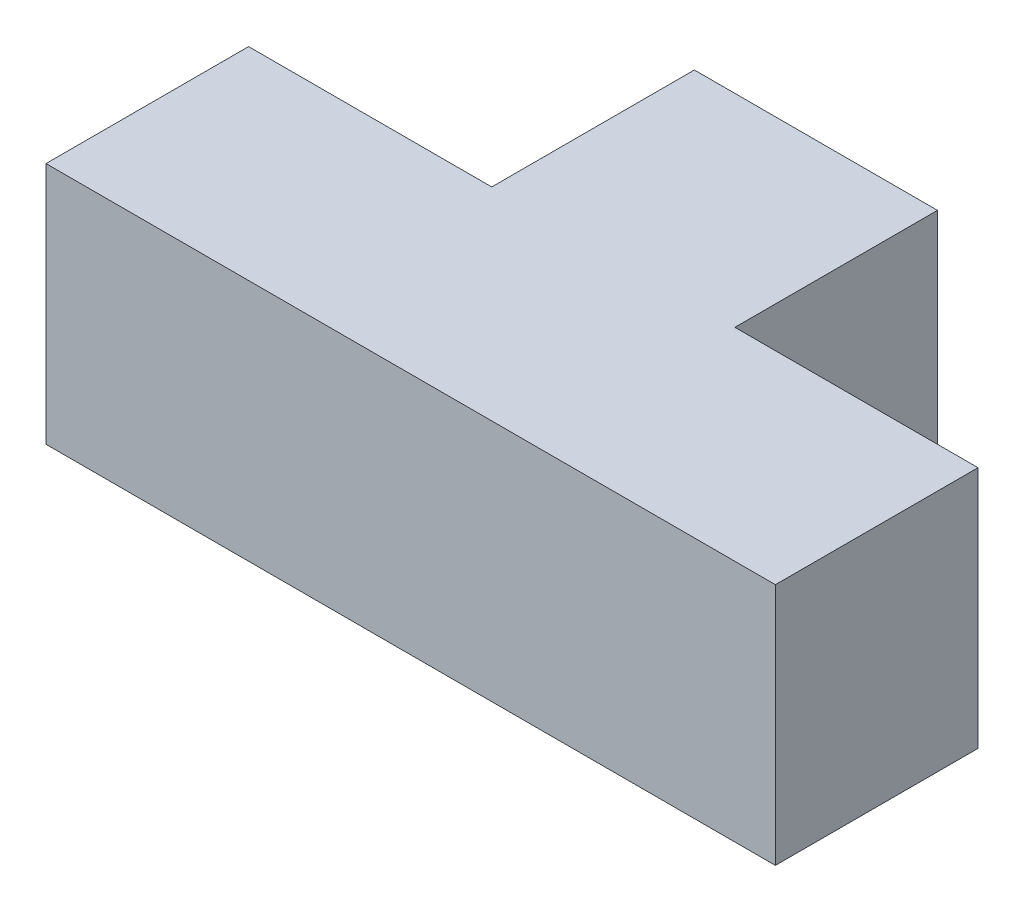
ISO-10303-21;
HEADER;
FILE_DESCRIPTION(('STEP AP214'),'2;1');
FILE_NAME('part.step','',(''),(''),'','','');
FILE_SCHEMA(('AUTOMOTIVE_DESIGN { 1 0 10303 214 1 1 1 1 }'));
ENDSEC;
DATA;
#1=APPLICATION_CONTEXT('core data for automotive mechanical design processes');
#2=APPLICATION_PROTOCOL_DEFINITION('international standard','automotive_design',2000,#1);
#3=PRODUCT_CONTEXT('',#1,'mechanical');
#4=PRODUCT('Part','Part','',(#3));
#5=PRODUCT_RELATED_PRODUCT_CATEGORY('part','',(#4));
#6=PRODUCT_DEFINITION_FORMATION('','',#4);
#7=PRODUCT_DEFINITION_CONTEXT('part definition',#1,'design');
#8=PRODUCT_DEFINITION('design','',#6,#7);
#9=PRODUCT_DEFINITION_SHAPE('','',#8);
#10=(LENGTH_UNIT() NAMED_UNIT(*) SI_UNIT(.MILLI.,.METRE.));
#11=(NAMED_UNIT(*) PLANE_ANGLE_UNIT() SI_UNIT($,.RADIAN.));
#12=(NAMED_UNIT(*) SI_UNIT($,.STERADIAN.) SOLID_ANGLE_UNIT());
#13=UNCERTAINTY_MEASURE_WITH_UNIT(LENGTH_MEASURE(1.E-05),#10,'distance_accuracy_value','');
#14=(GEOMETRIC_REPRESENTATION_CONTEXT(3) GLOBAL_UNCERTAINTY_ASSIGNED_CONTEXT((#13)) GLOBAL_UNIT_ASSIGNED_CONTEXT((#10,
#11,#12)) REPRESENTATION_CONTEXT('',''));
#15=CARTESIAN_POINT('',(0.,0.,0.));
#16=DIRECTION('',(0.,0.,1.));
#17=DIRECTION('',(1.,0.,0.));
#18=AXIS2_PLACEMENT_3D('',#15,#16,#17);
#19=CARTESIAN_POINT('',(0.,30.,-25.));
#20=DIRECTION('',(1.,0.,0.));
#21=DIRECTION('',(0.,0.,-1.));
#22=AXIS2_PLACEMENT_3D('',#19,#20,#21);
#23=PLANE('',#22);
#24=DIRECTION('',(0.,0.,1.));
#25=VECTOR('',#24,1.);
#26=CARTESIAN_POINT('',(0.,0.,-25.));
#27=LINE('',#26,#25);
#28=CARTESIAN_POINT('',(0.,0.,-25.));
#29=VERTEX_POINT('',#28);
#30=CARTESIAN_POINT('',(0.,0.,0.));
#31=VERTEX_POINT('',#30);
#32=EDGE_CURVE('E129',#29,#31,#27,.T.);
#33=ORIENTED_EDGE('',*,*,#32,.T.);
#34=DIRECTION('',(0.,-1.,0.));
#35=VECTOR('',#34,1.);
#36=CARTESIAN_POINT('',(0.,30.,0.));
#37=LINE('',#36,#35);
#38=CARTESIAN_POINT('',(0.,30.,0.));
#39=VERTEX_POINT('',#38);
#40=EDGE_CURVE('E11',#39,#31,#37,.T.);
#41=ORIENTED_EDGE('',*,*,#40,.F.);
#42=DIRECTION('',(0.,0.,1.));
#43=VECTOR('',#42,1.);
#44=CARTESIAN_POINT('',(0.,30.,-25.));
#45=LINE('',#44,#43);
#46=CARTESIAN_POINT('',(0.,30.,-25.));
#47=VERTEX_POINT('',#46);
#48=EDGE_CURVE('E143',#47,#39,#45,.T.);
#49=ORIENTED_EDGE('',*,*,#48,.F.);
#50=DIRECTION('',(0.,-1.,0.));
#51=VECTOR('',#50,1.);
#52=CARTESIAN_POINT('',(0.,30.,-25.));
#53=LINE('',#52,#51);
#54=EDGE_CURVE('E125',#47,#29,#53,.T.);
#55=ORIENTED_EDGE('',*,*,#54,.T.);
#56=EDGE_LOOP('',(#33,#41,#49,#55));
#57=FACE_BOUND('',#56,.T.);
#58=ADVANCED_FACE('F33',(#57),#23,.F.);
#59=CARTESIAN_POINT('',(0.,30.,0.));
#60=DIRECTION('',(0.,0.,-1.));
#61=DIRECTION('',(-1.,0.,0.));
#62=AXIS2_PLACEMENT_3D('',#59,#60,#61);
#63=PLANE('',#62);
#64=DIRECTION('',(1.,0.,0.));
#65=VECTOR('',#64,1.);
#66=CARTESIAN_POINT('',(0.,0.,0.));
#67=LINE('',#66,#65);
#68=CARTESIAN_POINT('',(90.,0.,0.));
#69=VERTEX_POINT('',#68);
#70=EDGE_CURVE('E132',#31,#69,#67,.T.);
#71=ORIENTED_EDGE('',*,*,#70,.T.);
#72=DIRECTION('',(0.,-1.,0.));
#73=VECTOR('',#72,1.);
#74=CARTESIAN_POINT('',(90.,30.,0.));
#75=LINE('',#74,#73);
#76=CARTESIAN_POINT('',(90.,30.,0.));
#77=VERTEX_POINT('',#76);
#78=EDGE_CURVE('E41',#77,#69,#75,.T.);
#79=ORIENTED_EDGE('',*,*,#78,.F.);
#80=DIRECTION('',(1.,0.,0.));
#81=VECTOR('',#80,1.);
#82=CARTESIAN_POINT('',(0.,30.,0.));
#83=LINE('',#82,#81);
#84=EDGE_CURVE('E92',#39,#77,#83,.T.);
#85=ORIENTED_EDGE('',*,*,#84,.F.);
#86=ORIENTED_EDGE('',*,*,#40,.T.);
#87=EDGE_LOOP('',(#71,#79,#85,#86));
#88=FACE_BOUND('',#87,.T.);
#89=ADVANCED_FACE('F178',(#88),#63,.F.);
#90=CARTESIAN_POINT('',(90.,30.,0.));
#91=DIRECTION('',(-1.,0.,0.));
#92=DIRECTION('',(0.,0.,1.));
#93=AXIS2_PLACEMENT_3D('',#90,#91,#92);
#94=PLANE('',#93);
#95=DIRECTION('',(0.,0.,-1.));
#96=VECTOR('',#95,1.);
#97=CARTESIAN_POINT('',(90.,0.,0.));
#98=LINE('',#97,#96);
#99=CARTESIAN_POINT('',(90.,0.,-25.));
#100=VERTEX_POINT('',#99);
#101=EDGE_CURVE('E134',#69,#100,#98,.T.);
#102=ORIENTED_EDGE('',*,*,#101,.T.);
#103=DIRECTION('',(0.,-1.,0.));
#104=VECTOR('',#103,1.);
#105=CARTESIAN_POINT('',(90.,30.,-25.));
#106=LINE('',#105,#104);
#107=CARTESIAN_POINT('',(90.,30.,-25.));
#108=VERTEX_POINT('',#107);
#109=EDGE_CURVE('E150',#108,#100,#106,.T.);
#110=ORIENTED_EDGE('',*,*,#109,.F.);
#111=DIRECTION('',(0.,0.,-1.));
#112=VECTOR('',#111,1.);
#113=CARTESIAN_POINT('',(90.,30.,0.));
#114=LINE('',#113,#112);
#115=EDGE_CURVE('E158',#77,#108,#114,.T.);
#116=ORIENTED_EDGE('',*,*,#115,.F.);
#117=ORIENTED_EDGE('',*,*,#78,.T.);
#118=EDGE_LOOP('',(#102,#110,#116,#117));
#119=FACE_BOUND('',#118,.T.);
#120=ADVANCED_FACE('F156',(#119),#94,.F.);
#121=CARTESIAN_POINT('',(90.,30.,-25.));
#122=DIRECTION('',(0.,0.,1.));
#123=DIRECTION('',(1.,0.,0.));
#124=AXIS2_PLACEMENT_3D('',#121,#122,#123);
#125=PLANE('',#124);
#126=DIRECTION('',(-1.,0.,0.));
#127=VECTOR('',#126,1.);
#128=CARTESIAN_POINT('',(90.,0.,-25.));
#129=LINE('',#128,#127);
#130=CARTESIAN_POINT('',(60.,0.,-25.));
#131=VERTEX_POINT('',#130);
#132=EDGE_CURVE('E136',#100,#131,#129,.T.);
#133=ORIENTED_EDGE('',*,*,#132,.T.);
#134=DIRECTION('',(0.,-1.,0.));
#135=VECTOR('',#134,1.);
#136=CARTESIAN_POINT('',(60.,30.,-25.));
#137=LINE('',#136,#135);
#138=CARTESIAN_POINT('',(60.,30.,-25.));
#139=VERTEX_POINT('',#138);
#140=EDGE_CURVE('E147',#139,#131,#137,.T.);
#141=ORIENTED_EDGE('',*,*,#140,.F.);
#142=DIRECTION('',(-1.,0.,0.));
#143=VECTOR('',#142,1.);
#144=CARTESIAN_POINT('',(90.,30.,-25.));
#145=LINE('',#144,#143);
#146=EDGE_CURVE('E170',#108,#139,#145,.T.);
#147=ORIENTED_EDGE('',*,*,#146,.F.);
#148=ORIENTED_EDGE('',*,*,#109,.T.);
#149=EDGE_LOOP('',(#133,#141,#147,#148));
#150=FACE_BOUND('',#149,.T.);
#151=ADVANCED_FACE('F166',(#150),#125,.F.);
#152=CARTESIAN_POINT('',(60.,30.,-25.));
#153=DIRECTION('',(-1.,0.,0.));
#154=DIRECTION('',(0.,0.,1.));
#155=AXIS2_PLACEMENT_3D('',#152,#153,#154);
#156=PLANE('',#155);
#157=DIRECTION('',(0.,0.,-1.));
#158=VECTOR('',#157,1.);
#159=CARTESIAN_POINT('',(60.,0.,-25.));
#160=LINE('',#159,#158);
#161=CARTESIAN_POINT('',(60.,0.,-50.));
#162=VERTEX_POINT('',#161);
#163=EDGE_CURVE('E138',#131,#162,#160,.T.);
#164=ORIENTED_EDGE('',*,*,#163,.T.);
#165=DIRECTION('',(0.,-1.,0.));
#166=VECTOR('',#165,1.);
#167=CARTESIAN_POINT('',(60.,30.,-50.));
#168=LINE('',#167,#166);
#169=CARTESIAN_POINT('',(60.,30.,-50.));
#170=VERTEX_POINT('',#169);
#171=EDGE_CURVE('E120',#170,#162,#168,.T.);
#172=ORIENTED_EDGE('',*,*,#171,.F.);
#173=DIRECTION('',(0.,0.,-1.));
#174=VECTOR('',#173,1.);
#175=CARTESIAN_POINT('',(60.,30.,-25.));
#176=LINE('',#175,#174);
#177=EDGE_CURVE('E111',#139,#170,#176,.T.);
#178=ORIENTED_EDGE('',*,*,#177,.F.);
#179=ORIENTED_EDGE('',*,*,#140,.T.);
#180=EDGE_LOOP('',(#164,#172,#178,#179));
#181=FACE_BOUND('',#180,.T.);
#182=ADVANCED_FACE('F169',(#181),#156,.F.);
#183=CARTESIAN_POINT('',(60.,30.,-50.));
#184=DIRECTION('',(0.,0.,1.));
#185=DIRECTION('',(1.,0.,0.));
#186=AXIS2_PLACEMENT_3D('',#183,#184,#185);
#187=PLANE('',#186);
#188=DIRECTION('',(-1.,0.,0.));
#189=VECTOR('',#188,1.);
#190=CARTESIAN_POINT('',(60.,0.,-50.));
#191=LINE('',#190,#189);
#192=CARTESIAN_POINT('',(30.,0.,-50.));
#193=VERTEX_POINT('',#192);
#194=EDGE_CURVE('E119',#162,#193,#191,.T.);
#195=ORIENTED_EDGE('',*,*,#194,.T.);
#196=DIRECTION('',(0.,-1.,0.));
#197=VECTOR('',#196,1.);
#198=CARTESIAN_POINT('',(30.,30.,-50.));
#199=LINE('',#198,#197);
#200=CARTESIAN_POINT('',(30.,30.,-50.));
#201=VERTEX_POINT('',#200);
#202=EDGE_CURVE('E116',#201,#193,#199,.T.);
#203=ORIENTED_EDGE('',*,*,#202,.F.);
#204=DIRECTION('',(-1.,0.,0.));
#205=VECTOR('',#204,1.);
#206=CARTESIAN_POINT('',(60.,30.,-50.));
#207=LINE('',#206,#205);
#208=EDGE_CURVE('E105',#170,#201,#207,.T.);
#209=ORIENTED_EDGE('',*,*,#208,.F.);
#210=ORIENTED_EDGE('',*,*,#171,.T.);
#211=EDGE_LOOP('',(#195,#203,#209,#210));
#212=FACE_BOUND('',#211,.T.);
#213=ADVANCED_FACE('F117',(#212),#187,.F.);
#214=CARTESIAN_POINT('',(30.,30.,-50.));
#215=DIRECTION('',(1.,0.,0.));
#216=DIRECTION('',(0.,0.,-1.));
#217=AXIS2_PLACEMENT_3D('',#214,#215,#216);
#218=PLANE('',#217);
#219=DIRECTION('',(0.,0.,1.));
#220=VECTOR('',#219,1.);
#221=CARTESIAN_POINT('',(30.,0.,-50.));
#222=LINE('',#221,#220);
#223=CARTESIAN_POINT('',(30.,0.,-25.));
#224=VERTEX_POINT('',#223);
#225=EDGE_CURVE('E78',#193,#224,#222,.T.);
#226=ORIENTED_EDGE('',*,*,#225,.T.);
#227=DIRECTION('',(0.,-1.,0.));
#228=VECTOR('',#227,1.);
#229=CARTESIAN_POINT('',(30.,30.,-25.));
#230=LINE('',#229,#228);
#231=CARTESIAN_POINT('',(30.,30.,-25.));
#232=VERTEX_POINT('',#231);
#233=EDGE_CURVE('E121',#232,#224,#230,.T.);
#234=ORIENTED_EDGE('',*,*,#233,.F.);
#235=DIRECTION('',(0.,0.,1.));
#236=VECTOR('',#235,1.);
#237=CARTESIAN_POINT('',(30.,30.,-50.));
#238=LINE('',#237,#236);
#239=EDGE_CURVE('E109',#201,#232,#238,.T.);
#240=ORIENTED_EDGE('',*,*,#239,.F.);
#241=ORIENTED_EDGE('',*,*,#202,.T.);
#242=EDGE_LOOP('',(#226,#234,#240,#241));
#243=FACE_BOUND('',#242,.T.);
#244=ADVANCED_FACE('F123',(#243),#218,.F.);
#245=CARTESIAN_POINT('',(30.,30.,-25.));
#246=DIRECTION('',(0.,0.,1.));
#247=DIRECTION('',(1.,0.,0.));
#248=AXIS2_PLACEMENT_3D('',#245,#246,#247);
#249=PLANE('',#248);
#250=DIRECTION('',(-1.,0.,0.));
#251=VECTOR('',#250,1.);
#252=CARTESIAN_POINT('',(30.,0.,-25.));
#253=LINE('',#252,#251);
#254=EDGE_CURVE('E84',#224,#29,#253,.T.);
#255=ORIENTED_EDGE('',*,*,#254,.T.);
#256=ORIENTED_EDGE('',*,*,#54,.F.);
#257=DIRECTION('',(-1.,0.,0.));
#258=VECTOR('',#257,1.);
#259=CARTESIAN_POINT('',(30.,30.,-25.));
#260=LINE('',#259,#258);
#261=EDGE_CURVE('E49',#232,#47,#260,.T.);
#262=ORIENTED_EDGE('',*,*,#261,.F.);
#263=ORIENTED_EDGE('',*,*,#233,.T.);
#264=EDGE_LOOP('',(#255,#256,#262,#263));
#265=FACE_BOUND('',#264,.T.);
#266=ADVANCED_FACE('F194',(#265),#249,.F.);
#267=CARTESIAN_POINT('',(0.,30.,0.));
#268=DIRECTION('',(0.,1.,0.));
#269=DIRECTION('',(0.,0.,1.));
#270=AXIS2_PLACEMENT_3D('',#267,#268,#269);
#271=PLANE('',#270);
#272=ORIENTED_EDGE('',*,*,#48,.T.);
#273=ORIENTED_EDGE('',*,*,#84,.T.);
#274=ORIENTED_EDGE('',*,*,#115,.T.);
#275=ORIENTED_EDGE('',*,*,#146,.T.);
#276=ORIENTED_EDGE('',*,*,#177,.T.);
#277=ORIENTED_EDGE('',*,*,#208,.T.);
#278=ORIENTED_EDGE('',*,*,#239,.T.);
#279=ORIENTED_EDGE('',*,*,#261,.T.);
#280=EDGE_LOOP('',(#272,#273,#274,#275,#276,#277,#278,#279));
#281=FACE_BOUND('',#280,.T.);
#282=ADVANCED_FACE('F107',(#281),#271,.T.);
#283=CARTESIAN_POINT('',(0.,0.,0.));
#284=DIRECTION('',(0.,1.,0.));
#285=DIRECTION('',(0.,0.,1.));
#286=AXIS2_PLACEMENT_3D('',#283,#284,#285);
#287=PLANE('',#286);
#288=ORIENTED_EDGE('',*,*,#32,.F.);
#289=ORIENTED_EDGE('',*,*,#254,.F.);
#290=ORIENTED_EDGE('',*,*,#225,.F.);
#291=ORIENTED_EDGE('',*,*,#194,.F.);
#292=ORIENTED_EDGE('',*,*,#163,.F.);
#293=ORIENTED_EDGE('',*,*,#132,.F.);
#294=ORIENTED_EDGE('',*,*,#101,.F.);
#295=ORIENTED_EDGE('',*,*,#70,.F.);
#296=EDGE_LOOP('',(#288,#289,#290,#291,#292,#293,#294,#295));
#297=FACE_BOUND('',#296,.T.);
#298=ADVANCED_FACE('F162',(#297),#287,.F.);
#299=CLOSED_SHELL('',(#58,#89,#120,#151,#182,#213,#244,#266,#282,#298));
#300=MANIFOLD_SOLID_BREP('B2',#299);
#301=ADVANCED_BREP_SHAPE_REPRESENTATION('',(#18,#300),#14);
#302=SHAPE_DEFINITION_REPRESENTATION(#9,#301);
ENDSEC;
END-ISO-10303-21;
